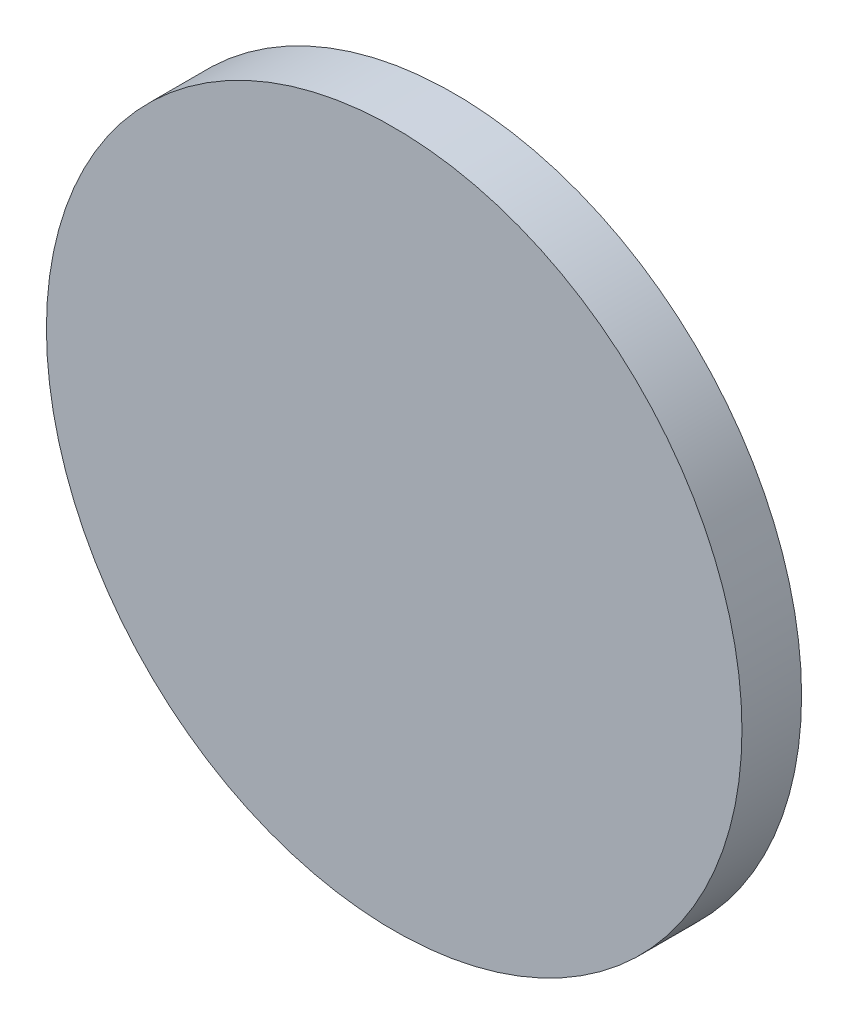
ISO-10303-21;
HEADER;
FILE_DESCRIPTION(('STEP AP214'),'2;1');
FILE_NAME('part.step','',(''),(''),'','','');
FILE_SCHEMA(('AUTOMOTIVE_DESIGN { 1 0 10303 214 1 1 1 1 }'));
ENDSEC;
DATA;
#1=APPLICATION_CONTEXT('core data for automotive mechanical design processes');
#2=APPLICATION_PROTOCOL_DEFINITION('international standard','automotive_design',2000,#1);
#3=PRODUCT_CONTEXT('',#1,'mechanical');
#4=PRODUCT('Part','Part','',(#3));
#5=PRODUCT_RELATED_PRODUCT_CATEGORY('part','',(#4));
#6=PRODUCT_DEFINITION_FORMATION('','',#4);
#7=PRODUCT_DEFINITION_CONTEXT('part definition',#1,'design');
#8=PRODUCT_DEFINITION('design','',#6,#7);
#9=PRODUCT_DEFINITION_SHAPE('','',#8);
#10=(LENGTH_UNIT() NAMED_UNIT(*) SI_UNIT(.MILLI.,.METRE.));
#11=(NAMED_UNIT(*) PLANE_ANGLE_UNIT() SI_UNIT($,.RADIAN.));
#12=(NAMED_UNIT(*) SI_UNIT($,.STERADIAN.) SOLID_ANGLE_UNIT());
#13=UNCERTAINTY_MEASURE_WITH_UNIT(LENGTH_MEASURE(1.E-05),#10,'distance_accuracy_value','');
#14=(GEOMETRIC_REPRESENTATION_CONTEXT(3) GLOBAL_UNCERTAINTY_ASSIGNED_CONTEXT((#13)) GLOBAL_UNIT_ASSIGNED_CONTEXT((#10,
#11,#12)) REPRESENTATION_CONTEXT('',''));
#15=CARTESIAN_POINT('',(0.,0.,0.));
#16=DIRECTION('',(0.,0.,1.));
#17=DIRECTION('',(1.,0.,0.));
#18=AXIS2_PLACEMENT_3D('',#15,#16,#17);
#19=CARTESIAN_POINT('',(11.576,9.760000014875,0.));
#20=DIRECTION('',(0.,0.,-1.));
#21=DIRECTION('',(-1.,0.,0.));
#22=AXIS2_PLACEMENT_3D('',#19,#20,#21);
#23=PLANE('',#22);
#24=CARTESIAN_POINT('',(11.576,9.760000014875,0.));
#25=DIRECTION('',(0.,0.,1.));
#26=DIRECTION('',(1.,0.,0.));
#27=AXIS2_PLACEMENT_3D('',#24,#25,#26);
#28=CIRCLE('',#27,0.200024667);
#29=CARTESIAN_POINT('',(11.776024667,9.760000014875,0.));
#30=VERTEX_POINT('',#29);
#31=EDGE_CURVE('E18',#30,#30,#28,.T.);
#32=ORIENTED_EDGE('',*,*,#31,.F.);
#33=EDGE_LOOP('',(#32));
#34=FACE_BOUND('',#33,.T.);
#35=ADVANCED_FACE('F15',(#34),#23,.T.);
#36=CARTESIAN_POINT('',(11.576,9.760000014875,0.));
#37=DIRECTION('',(0.,0.,1.));
#38=DIRECTION('',(1.,0.,0.));
#39=AXIS2_PLACEMENT_3D('',#36,#37,#38);
#40=CYLINDRICAL_SURFACE('',#39,0.200024667);
#41=CARTESIAN_POINT('',(11.576,9.760000014875,0.03429));
#42=DIRECTION('',(0.,0.,1.));
#43=DIRECTION('',(1.,0.,0.));
#44=AXIS2_PLACEMENT_3D('',#41,#42,#43);
#45=CIRCLE('',#44,0.200024667);
#46=CARTESIAN_POINT('',(11.776024667,9.760000014875,0.03429));
#47=VERTEX_POINT('',#46);
#48=EDGE_CURVE('E10',#47,#47,#45,.T.);
#49=ORIENTED_EDGE('',*,*,#48,.F.);
#50=EDGE_LOOP('',(#49));
#51=FACE_BOUND('',#50,.T.);
#52=ORIENTED_EDGE('',*,*,#31,.T.);
#53=EDGE_LOOP('',(#52));
#54=FACE_BOUND('',#53,.T.);
#55=ADVANCED_FACE('F27',(#51,#54),#40,.T.);
#56=CARTESIAN_POINT('',(11.576,9.760000014875,0.03429));
#57=DIRECTION('',(0.,0.,1.));
#58=DIRECTION('',(1.,0.,0.));
#59=AXIS2_PLACEMENT_3D('',#56,#57,#58);
#60=PLANE('',#59);
#61=ORIENTED_EDGE('',*,*,#48,.T.);
#62=EDGE_LOOP('',(#61));
#63=FACE_BOUND('',#62,.T.);
#64=ADVANCED_FACE('F34',(#63),#60,.T.);
#65=CLOSED_SHELL('',(#35,#55,#64));
#66=MANIFOLD_SOLID_BREP('B1',#65);
#67=ADVANCED_BREP_SHAPE_REPRESENTATION('',(#18,#66),#14);
#68=SHAPE_DEFINITION_REPRESENTATION(#9,#67);
ENDSEC;
END-ISO-10303-21;
